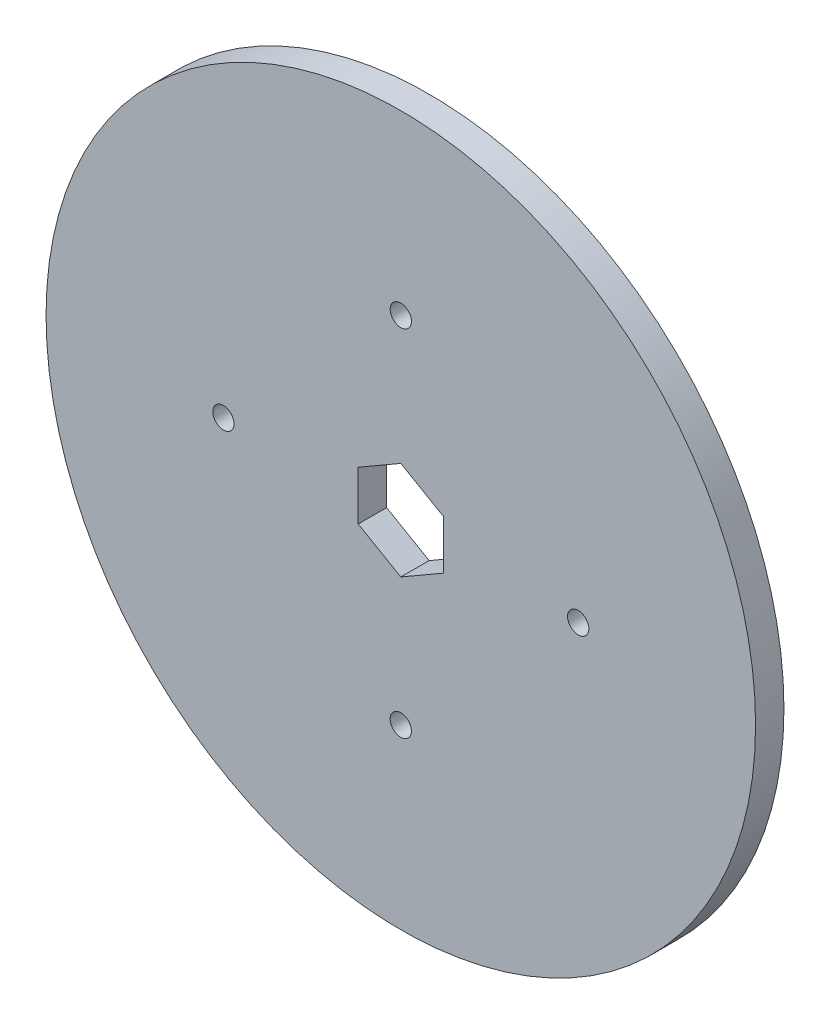
ISO-10303-21;
HEADER;
FILE_DESCRIPTION(('STEP AP214'),'2;1');
FILE_NAME('part.step','',(''),(''),'','','');
FILE_SCHEMA(('AUTOMOTIVE_DESIGN { 1 0 10303 214 1 1 1 1 }'));
ENDSEC;
DATA;
#1=APPLICATION_CONTEXT('core data for automotive mechanical design processes');
#2=APPLICATION_PROTOCOL_DEFINITION('international standard','automotive_design',2000,#1);
#3=PRODUCT_CONTEXT('',#1,'mechanical');
#4=PRODUCT('Part','Part','',(#3));
#5=PRODUCT_RELATED_PRODUCT_CATEGORY('part','',(#4));
#6=PRODUCT_DEFINITION_FORMATION('','',#4);
#7=PRODUCT_DEFINITION_CONTEXT('part definition',#1,'design');
#8=PRODUCT_DEFINITION('design','',#6,#7);
#9=PRODUCT_DEFINITION_SHAPE('','',#8);
#10=(LENGTH_UNIT() NAMED_UNIT(*) SI_UNIT(.MILLI.,.METRE.));
#11=(NAMED_UNIT(*) PLANE_ANGLE_UNIT() SI_UNIT($,.RADIAN.));
#12=(NAMED_UNIT(*) SI_UNIT($,.STERADIAN.) SOLID_ANGLE_UNIT());
#13=UNCERTAINTY_MEASURE_WITH_UNIT(LENGTH_MEASURE(1.E-05),#10,'distance_accuracy_value','');
#14=(GEOMETRIC_REPRESENTATION_CONTEXT(3) GLOBAL_UNCERTAINTY_ASSIGNED_CONTEXT((#13)) GLOBAL_UNIT_ASSIGNED_CONTEXT((#10,
#11,#12)) REPRESENTATION_CONTEXT('',''));
#15=CARTESIAN_POINT('',(0.,0.,0.));
#16=DIRECTION('',(0.,0.,1.));
#17=DIRECTION('',(1.,0.,0.));
#18=AXIS2_PLACEMENT_3D('',#15,#16,#17);
#19=CARTESIAN_POINT('',(-42.2867192924577,29.93899725906,4.));
#20=DIRECTION('',(0.,0.,-1.));
#21=DIRECTION('',(-1.,0.,0.));
#22=AXIS2_PLACEMENT_3D('',#19,#20,#21);
#23=CYLINDRICAL_SURFACE('',#22,50.);
#24=CARTESIAN_POINT('',(-42.2867192924577,29.93899725906,4.));
#25=DIRECTION('',(0.,0.,1.));
#26=DIRECTION('',(1.,0.,0.));
#27=AXIS2_PLACEMENT_3D('',#24,#25,#26);
#28=CIRCLE('',#27,50.);
#29=CARTESIAN_POINT('',(7.71328070754233,29.93899725906,4.));
#30=VERTEX_POINT('',#29);
#31=EDGE_CURVE('E125',#30,#30,#28,.T.);
#32=ORIENTED_EDGE('',*,*,#31,.F.);
#33=EDGE_LOOP('',(#32));
#34=FACE_BOUND('',#33,.T.);
#35=CARTESIAN_POINT('',(-42.2867192924577,29.93899725906,0.));
#36=DIRECTION('',(0.,0.,1.));
#37=DIRECTION('',(1.,0.,0.));
#38=AXIS2_PLACEMENT_3D('',#35,#36,#37);
#39=CIRCLE('',#38,50.);
#40=CARTESIAN_POINT('',(7.71328070754233,29.93899725906,0.));
#41=VERTEX_POINT('',#40);
#42=EDGE_CURVE('E118',#41,#41,#39,.T.);
#43=ORIENTED_EDGE('',*,*,#42,.T.);
#44=EDGE_LOOP('',(#43));
#45=FACE_BOUND('',#44,.T.);
#46=ADVANCED_FACE('F33',(#34,#45),#23,.T.);
#47=CARTESIAN_POINT('',(-42.2867192924577,29.93899725906,4.));
#48=DIRECTION('',(0.,0.,1.));
#49=DIRECTION('',(1.,0.,0.));
#50=AXIS2_PLACEMENT_3D('',#47,#48,#49);
#51=PLANE('',#50);
#52=CARTESIAN_POINT('',(-42.2867192924579,4.93899725906007,4.));
#53=DIRECTION('',(0.,0.,1.));
#54=DIRECTION('',(1.,0.,0.));
#55=AXIS2_PLACEMENT_3D('',#52,#53,#54);
#56=CIRCLE('',#55,1.49999999999999);
#57=CARTESIAN_POINT('',(-40.7867192924579,4.93899725906007,4.));
#58=VERTEX_POINT('',#57);
#59=EDGE_CURVE('E170',#58,#58,#56,.T.);
#60=ORIENTED_EDGE('',*,*,#59,.F.);
#61=EDGE_LOOP('',(#60));
#62=FACE_BOUND('',#61,.T.);
#63=CARTESIAN_POINT('',(-17.2867192924577,29.9389972590599,4.));
#64=DIRECTION('',(0.,0.,1.));
#65=DIRECTION('',(1.,0.,0.));
#66=AXIS2_PLACEMENT_3D('',#63,#64,#65);
#67=CIRCLE('',#66,1.5);
#68=CARTESIAN_POINT('',(-15.7867192924577,29.9389972590599,4.));
#69=VERTEX_POINT('',#68);
#70=EDGE_CURVE('E164',#69,#69,#67,.T.);
#71=ORIENTED_EDGE('',*,*,#70,.F.);
#72=EDGE_LOOP('',(#71));
#73=FACE_BOUND('',#72,.T.);
#74=CARTESIAN_POINT('',(-42.2867192924576,54.93899725906,4.));
#75=DIRECTION('',(0.,0.,1.));
#76=DIRECTION('',(1.,0.,0.));
#77=AXIS2_PLACEMENT_3D('',#74,#75,#76);
#78=CIRCLE('',#77,1.5);
#79=CARTESIAN_POINT('',(-40.7867192924576,54.93899725906,4.));
#80=VERTEX_POINT('',#79);
#81=EDGE_CURVE('E158',#80,#80,#78,.T.);
#82=ORIENTED_EDGE('',*,*,#81,.F.);
#83=EDGE_LOOP('',(#82));
#84=FACE_BOUND('',#83,.T.);
#85=CARTESIAN_POINT('',(-67.2867192924577,29.93899725906,4.));
#86=DIRECTION('',(0.,0.,1.));
#87=DIRECTION('',(1.,0.,0.));
#88=AXIS2_PLACEMENT_3D('',#85,#86,#87);
#89=CIRCLE('',#88,1.5);
#90=CARTESIAN_POINT('',(-65.7867192924577,29.93899725906,4.));
#91=VERTEX_POINT('',#90);
#92=EDGE_CURVE('E152',#91,#91,#89,.T.);
#93=ORIENTED_EDGE('',*,*,#92,.F.);
#94=EDGE_LOOP('',(#93));
#95=FACE_BOUND('',#94,.T.);
#96=DIRECTION('',(0.866025403784439,-0.5,0.));
#97=VECTOR('',#96,1.);
#98=CARTESIAN_POINT('',(-48.2867192924577,26.4748956439223,4.));
#99=LINE('',#98,#97);
#100=CARTESIAN_POINT('',(-48.2867192924577,26.4748956439223,4.));
#101=VERTEX_POINT('',#100);
#102=CARTESIAN_POINT('',(-42.2867192924577,23.0107940287845,4.));
#103=VERTEX_POINT('',#102);
#104=EDGE_CURVE('E47',#101,#103,#99,.T.);
#105=ORIENTED_EDGE('',*,*,#104,.F.);
#106=DIRECTION('',(0.,-1.,0.));
#107=VECTOR('',#106,1.);
#108=CARTESIAN_POINT('',(-48.2867192924577,33.4030988741978,4.));
#109=LINE('',#108,#107);
#110=CARTESIAN_POINT('',(-48.2867192924577,33.4030988741978,4.));
#111=VERTEX_POINT('',#110);
#112=EDGE_CURVE('E113',#111,#101,#109,.T.);
#113=ORIENTED_EDGE('',*,*,#112,.F.);
#114=DIRECTION('',(-0.866025403784439,-0.5,0.));
#115=VECTOR('',#114,1.);
#116=CARTESIAN_POINT('',(-42.2867192924577,36.8672004893355,4.));
#117=LINE('',#116,#115);
#118=CARTESIAN_POINT('',(-42.2867192924577,36.8672004893355,4.));
#119=VERTEX_POINT('',#118);
#120=EDGE_CURVE('E107',#119,#111,#117,.T.);
#121=ORIENTED_EDGE('',*,*,#120,.F.);
#122=DIRECTION('',(-0.866025403784439,0.5,0.));
#123=VECTOR('',#122,1.);
#124=CARTESIAN_POINT('',(-36.2867192924577,33.4030988741978,4.));
#125=LINE('',#124,#123);
#126=CARTESIAN_POINT('',(-36.2867192924577,33.4030988741978,4.));
#127=VERTEX_POINT('',#126);
#128=EDGE_CURVE('E105',#127,#119,#125,.T.);
#129=ORIENTED_EDGE('',*,*,#128,.F.);
#130=DIRECTION('',(0.,1.,0.));
#131=VECTOR('',#130,1.);
#132=CARTESIAN_POINT('',(-36.2867192924577,26.4748956439223,4.));
#133=LINE('',#132,#131);
#134=CARTESIAN_POINT('',(-36.2867192924577,26.4748956439223,4.));
#135=VERTEX_POINT('',#134);
#136=EDGE_CURVE('E88',#135,#127,#133,.T.);
#137=ORIENTED_EDGE('',*,*,#136,.F.);
#138=DIRECTION('',(0.866025403784438,0.5,0.));
#139=VECTOR('',#138,1.);
#140=CARTESIAN_POINT('',(-42.2867192924577,23.0107940287845,4.));
#141=LINE('',#140,#139);
#142=EDGE_CURVE('E97',#103,#135,#141,.T.);
#143=ORIENTED_EDGE('',*,*,#142,.F.);
#144=EDGE_LOOP('',(#105,#113,#121,#129,#137,#143));
#145=FACE_BOUND('',#144,.T.);
#146=ORIENTED_EDGE('',*,*,#31,.T.);
#147=EDGE_LOOP('',(#146));
#148=FACE_BOUND('',#147,.T.);
#149=ADVANCED_FACE('F101',(#62,#73,#84,#95,#145,#148),#51,.T.);
#150=CARTESIAN_POINT('',(-42.2867192924577,29.93899725906,0.));
#151=DIRECTION('',(0.,0.,1.));
#152=DIRECTION('',(1.,0.,0.));
#153=AXIS2_PLACEMENT_3D('',#150,#151,#152);
#154=PLANE('',#153);
#155=CARTESIAN_POINT('',(-42.2867192924579,4.93899725906007,0.));
#156=DIRECTION('',(0.,0.,1.));
#157=DIRECTION('',(1.,0.,0.));
#158=AXIS2_PLACEMENT_3D('',#155,#156,#157);
#159=CIRCLE('',#158,1.49999999999999);
#160=CARTESIAN_POINT('',(-40.7867192924579,4.93899725906007,0.));
#161=VERTEX_POINT('',#160);
#162=EDGE_CURVE('E167',#161,#161,#159,.T.);
#163=ORIENTED_EDGE('',*,*,#162,.T.);
#164=EDGE_LOOP('',(#163));
#165=FACE_BOUND('',#164,.T.);
#166=CARTESIAN_POINT('',(-17.2867192924577,29.9389972590599,0.));
#167=DIRECTION('',(0.,0.,1.));
#168=DIRECTION('',(1.,0.,0.));
#169=AXIS2_PLACEMENT_3D('',#166,#167,#168);
#170=CIRCLE('',#169,1.5);
#171=CARTESIAN_POINT('',(-15.7867192924577,29.9389972590599,0.));
#172=VERTEX_POINT('',#171);
#173=EDGE_CURVE('E161',#172,#172,#170,.T.);
#174=ORIENTED_EDGE('',*,*,#173,.T.);
#175=EDGE_LOOP('',(#174));
#176=FACE_BOUND('',#175,.T.);
#177=CARTESIAN_POINT('',(-42.2867192924576,54.93899725906,0.));
#178=DIRECTION('',(0.,0.,1.));
#179=DIRECTION('',(1.,0.,0.));
#180=AXIS2_PLACEMENT_3D('',#177,#178,#179);
#181=CIRCLE('',#180,1.5);
#182=CARTESIAN_POINT('',(-40.7867192924576,54.93899725906,0.));
#183=VERTEX_POINT('',#182);
#184=EDGE_CURVE('E156',#183,#183,#181,.T.);
#185=ORIENTED_EDGE('',*,*,#184,.T.);
#186=EDGE_LOOP('',(#185));
#187=FACE_BOUND('',#186,.T.);
#188=CARTESIAN_POINT('',(-67.2867192924577,29.93899725906,0.));
#189=DIRECTION('',(0.,0.,1.));
#190=DIRECTION('',(1.,0.,0.));
#191=AXIS2_PLACEMENT_3D('',#188,#189,#190);
#192=CIRCLE('',#191,1.5);
#193=CARTESIAN_POINT('',(-65.7867192924577,29.93899725906,0.));
#194=VERTEX_POINT('',#193);
#195=EDGE_CURVE('E150',#194,#194,#192,.T.);
#196=ORIENTED_EDGE('',*,*,#195,.T.);
#197=EDGE_LOOP('',(#196));
#198=FACE_BOUND('',#197,.T.);
#199=DIRECTION('',(0.,-1.,0.));
#200=VECTOR('',#199,1.);
#201=CARTESIAN_POINT('',(-48.2867192924577,29.93899725906,0.));
#202=LINE('',#201,#200);
#203=CARTESIAN_POINT('',(-48.2867192924577,33.4030988741978,0.));
#204=VERTEX_POINT('',#203);
#205=CARTESIAN_POINT('',(-48.2867192924577,26.4748956439223,0.));
#206=VERTEX_POINT('',#205);
#207=EDGE_CURVE('E40',#204,#206,#202,.T.);
#208=ORIENTED_EDGE('',*,*,#207,.T.);
#209=DIRECTION('',(0.866025403784439,-0.5,0.));
#210=VECTOR('',#209,1.);
#211=CARTESIAN_POINT('',(-45.2867192924577,24.7428448363534,0.));
#212=LINE('',#211,#210);
#213=CARTESIAN_POINT('',(-42.2867192924577,23.0107940287845,0.));
#214=VERTEX_POINT('',#213);
#215=EDGE_CURVE('E11',#206,#214,#212,.T.);
#216=ORIENTED_EDGE('',*,*,#215,.T.);
#217=DIRECTION('',(0.866025403784439,0.5,0.));
#218=VECTOR('',#217,1.);
#219=CARTESIAN_POINT('',(-39.2867192924577,24.7428448363534,0.));
#220=LINE('',#219,#218);
#221=CARTESIAN_POINT('',(-36.2867192924577,26.4748956439223,0.));
#222=VERTEX_POINT('',#221);
#223=EDGE_CURVE('E128',#214,#222,#220,.T.);
#224=ORIENTED_EDGE('',*,*,#223,.T.);
#225=DIRECTION('',(0.,1.,0.));
#226=VECTOR('',#225,1.);
#227=CARTESIAN_POINT('',(-36.2867192924577,29.93899725906,0.));
#228=LINE('',#227,#226);
#229=CARTESIAN_POINT('',(-36.2867192924577,33.4030988741978,0.));
#230=VERTEX_POINT('',#229);
#231=EDGE_CURVE('E91',#222,#230,#228,.T.);
#232=ORIENTED_EDGE('',*,*,#231,.T.);
#233=DIRECTION('',(-0.866025403784439,0.5,0.));
#234=VECTOR('',#233,1.);
#235=CARTESIAN_POINT('',(-39.2867192924577,35.1351496817667,0.));
#236=LINE('',#235,#234);
#237=CARTESIAN_POINT('',(-42.2867192924577,36.8672004893355,0.));
#238=VERTEX_POINT('',#237);
#239=EDGE_CURVE('E133',#230,#238,#236,.T.);
#240=ORIENTED_EDGE('',*,*,#239,.T.);
#241=DIRECTION('',(-0.866025403784439,-0.5,0.));
#242=VECTOR('',#241,1.);
#243=CARTESIAN_POINT('',(-45.2867192924577,35.1351496817667,0.));
#244=LINE('',#243,#242);
#245=EDGE_CURVE('E136',#238,#204,#244,.T.);
#246=ORIENTED_EDGE('',*,*,#245,.T.);
#247=EDGE_LOOP('',(#208,#216,#224,#232,#240,#246));
#248=FACE_BOUND('',#247,.T.);
#249=ORIENTED_EDGE('',*,*,#42,.F.);
#250=EDGE_LOOP('',(#249));
#251=FACE_BOUND('',#250,.T.);
#252=ADVANCED_FACE('F140',(#165,#176,#187,#198,#248,#251),#154,.F.);
#253=CARTESIAN_POINT('',(-48.2867192924577,26.4748956439223,-8.));
#254=DIRECTION('',(-0.5,-0.866025403784439,0.));
#255=DIRECTION('',(0.866025403784439,-0.5,0.));
#256=AXIS2_PLACEMENT_3D('',#253,#254,#255);
#257=PLANE('',#256);
#258=DIRECTION('',(0.,0.,1.));
#259=VECTOR('',#258,1.);
#260=CARTESIAN_POINT('',(-48.2867192924577,26.4748956439223,-8.));
#261=LINE('',#260,#259);
#262=EDGE_CURVE('E116',#206,#101,#261,.T.);
#263=ORIENTED_EDGE('',*,*,#262,.T.);
#264=ORIENTED_EDGE('',*,*,#104,.T.);
#265=DIRECTION('',(0.,0.,1.));
#266=VECTOR('',#265,1.);
#267=CARTESIAN_POINT('',(-42.2867192924577,23.0107940287845,-8.));
#268=LINE('',#267,#266);
#269=EDGE_CURVE('E94',#214,#103,#268,.T.);
#270=ORIENTED_EDGE('',*,*,#269,.F.);
#271=ORIENTED_EDGE('',*,*,#215,.F.);
#272=EDGE_LOOP('',(#263,#264,#270,#271));
#273=FACE_BOUND('',#272,.T.);
#274=ADVANCED_FACE('F216',(#273),#257,.F.);
#275=CARTESIAN_POINT('',(-48.2867192924577,33.4030988741978,-8.));
#276=DIRECTION('',(-1.,0.,0.));
#277=DIRECTION('',(0.,0.,1.));
#278=AXIS2_PLACEMENT_3D('',#275,#276,#277);
#279=PLANE('',#278);
#280=DIRECTION('',(0.,0.,1.));
#281=VECTOR('',#280,1.);
#282=CARTESIAN_POINT('',(-48.2867192924577,33.4030988741978,-8.));
#283=LINE('',#282,#281);
#284=EDGE_CURVE('E119',#204,#111,#283,.T.);
#285=ORIENTED_EDGE('',*,*,#284,.T.);
#286=ORIENTED_EDGE('',*,*,#112,.T.);
#287=ORIENTED_EDGE('',*,*,#262,.F.);
#288=ORIENTED_EDGE('',*,*,#207,.F.);
#289=EDGE_LOOP('',(#285,#286,#287,#288));
#290=FACE_BOUND('',#289,.T.);
#291=ADVANCED_FACE('F145',(#290),#279,.F.);
#292=CARTESIAN_POINT('',(-42.2867192924577,36.8672004893355,-8.));
#293=DIRECTION('',(-0.5,0.866025403784439,0.));
#294=DIRECTION('',(-0.866025403784439,-0.5,0.));
#295=AXIS2_PLACEMENT_3D('',#292,#293,#294);
#296=PLANE('',#295);
#297=DIRECTION('',(0.,0.,1.));
#298=VECTOR('',#297,1.);
#299=CARTESIAN_POINT('',(-42.2867192924577,36.8672004893355,-8.));
#300=LINE('',#299,#298);
#301=EDGE_CURVE('E121',#238,#119,#300,.T.);
#302=ORIENTED_EDGE('',*,*,#301,.T.);
#303=ORIENTED_EDGE('',*,*,#120,.T.);
#304=ORIENTED_EDGE('',*,*,#284,.F.);
#305=ORIENTED_EDGE('',*,*,#245,.F.);
#306=EDGE_LOOP('',(#302,#303,#304,#305));
#307=FACE_BOUND('',#306,.T.);
#308=ADVANCED_FACE('F147',(#307),#296,.F.);
#309=CARTESIAN_POINT('',(-36.2867192924577,33.4030988741978,-8.));
#310=DIRECTION('',(0.5,0.866025403784439,0.));
#311=DIRECTION('',(-0.866025403784439,0.5,0.));
#312=AXIS2_PLACEMENT_3D('',#309,#310,#311);
#313=PLANE('',#312);
#314=DIRECTION('',(0.,0.,1.));
#315=VECTOR('',#314,1.);
#316=CARTESIAN_POINT('',(-36.2867192924577,33.4030988741978,-8.));
#317=LINE('',#316,#315);
#318=EDGE_CURVE('E93',#230,#127,#317,.T.);
#319=ORIENTED_EDGE('',*,*,#318,.T.);
#320=ORIENTED_EDGE('',*,*,#128,.T.);
#321=ORIENTED_EDGE('',*,*,#301,.F.);
#322=ORIENTED_EDGE('',*,*,#239,.F.);
#323=EDGE_LOOP('',(#319,#320,#321,#322));
#324=FACE_BOUND('',#323,.T.);
#325=ADVANCED_FACE('F224',(#324),#313,.F.);
#326=CARTESIAN_POINT('',(-36.2867192924577,26.4748956439223,-8.));
#327=DIRECTION('',(1.,0.,0.));
#328=DIRECTION('',(0.,0.,-1.));
#329=AXIS2_PLACEMENT_3D('',#326,#327,#328);
#330=PLANE('',#329);
#331=DIRECTION('',(0.,0.,1.));
#332=VECTOR('',#331,1.);
#333=CARTESIAN_POINT('',(-36.2867192924577,26.4748956439223,-8.));
#334=LINE('',#333,#332);
#335=EDGE_CURVE('E55',#222,#135,#334,.T.);
#336=ORIENTED_EDGE('',*,*,#335,.T.);
#337=ORIENTED_EDGE('',*,*,#136,.T.);
#338=ORIENTED_EDGE('',*,*,#318,.F.);
#339=ORIENTED_EDGE('',*,*,#231,.F.);
#340=EDGE_LOOP('',(#336,#337,#338,#339));
#341=FACE_BOUND('',#340,.T.);
#342=ADVANCED_FACE('F85',(#341),#330,.F.);
#343=CARTESIAN_POINT('',(-42.2867192924577,23.0107940287845,-8.));
#344=DIRECTION('',(0.5,-0.866025403784438,0.));
#345=DIRECTION('',(0.866025403784439,0.5,0.));
#346=AXIS2_PLACEMENT_3D('',#343,#344,#345);
#347=PLANE('',#346);
#348=ORIENTED_EDGE('',*,*,#269,.T.);
#349=ORIENTED_EDGE('',*,*,#142,.T.);
#350=ORIENTED_EDGE('',*,*,#335,.F.);
#351=ORIENTED_EDGE('',*,*,#223,.F.);
#352=EDGE_LOOP('',(#348,#349,#350,#351));
#353=FACE_BOUND('',#352,.T.);
#354=ADVANCED_FACE('F98',(#353),#347,.F.);
#355=CARTESIAN_POINT('',(-67.2867192924577,29.93899725906,0.));
#356=DIRECTION('',(0.,0.,1.));
#357=DIRECTION('',(1.,0.,0.));
#358=AXIS2_PLACEMENT_3D('',#355,#356,#357);
#359=CYLINDRICAL_SURFACE('',#358,1.5);
#360=ORIENTED_EDGE('',*,*,#195,.F.);
#361=EDGE_LOOP('',(#360));
#362=FACE_BOUND('',#361,.T.);
#363=ORIENTED_EDGE('',*,*,#92,.T.);
#364=EDGE_LOOP('',(#363));
#365=FACE_BOUND('',#364,.T.);
#366=ADVANCED_FACE('F194',(#362,#365),#359,.F.);
#367=CARTESIAN_POINT('',(-42.2867192924576,54.93899725906,0.));
#368=DIRECTION('',(0.,0.,1.));
#369=DIRECTION('',(1.,0.,0.));
#370=AXIS2_PLACEMENT_3D('',#367,#368,#369);
#371=CYLINDRICAL_SURFACE('',#370,1.5);
#372=ORIENTED_EDGE('',*,*,#184,.F.);
#373=EDGE_LOOP('',(#372));
#374=FACE_BOUND('',#373,.T.);
#375=ORIENTED_EDGE('',*,*,#81,.T.);
#376=EDGE_LOOP('',(#375));
#377=FACE_BOUND('',#376,.T.);
#378=ADVANCED_FACE('F196',(#374,#377),#371,.F.);
#379=CARTESIAN_POINT('',(-17.2867192924577,29.9389972590599,0.));
#380=DIRECTION('',(0.,0.,1.));
#381=DIRECTION('',(1.,0.,0.));
#382=AXIS2_PLACEMENT_3D('',#379,#380,#381);
#383=CYLINDRICAL_SURFACE('',#382,1.5);
#384=ORIENTED_EDGE('',*,*,#173,.F.);
#385=EDGE_LOOP('',(#384));
#386=FACE_BOUND('',#385,.T.);
#387=ORIENTED_EDGE('',*,*,#70,.T.);
#388=EDGE_LOOP('',(#387));
#389=FACE_BOUND('',#388,.T.);
#390=ADVANCED_FACE('F181',(#386,#389),#383,.F.);
#391=CARTESIAN_POINT('',(-42.2867192924579,4.93899725906007,0.));
#392=DIRECTION('',(0.,0.,1.));
#393=DIRECTION('',(1.,0.,0.));
#394=AXIS2_PLACEMENT_3D('',#391,#392,#393);
#395=CYLINDRICAL_SURFACE('',#394,1.49999999999999);
#396=ORIENTED_EDGE('',*,*,#162,.F.);
#397=EDGE_LOOP('',(#396));
#398=FACE_BOUND('',#397,.T.);
#399=ORIENTED_EDGE('',*,*,#59,.T.);
#400=EDGE_LOOP('',(#399));
#401=FACE_BOUND('',#400,.T.);
#402=ADVANCED_FACE('F178',(#398,#401),#395,.F.);
#403=CLOSED_SHELL('',(#46,#149,#252,#274,#291,#308,#325,#342,#354,#366,#378,#390,#402));
#404=MANIFOLD_SOLID_BREP('B2',#403);
#405=ADVANCED_BREP_SHAPE_REPRESENTATION('',(#18,#404),#14);
#406=SHAPE_DEFINITION_REPRESENTATION(#9,#405);
ENDSEC;
END-ISO-10303-21;
